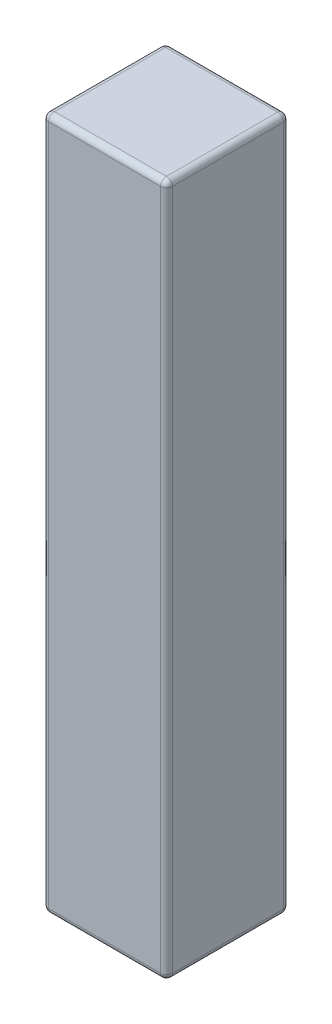
ISO-10303-21;
HEADER;
FILE_DESCRIPTION(('STEP AP214'),'2;1');
FILE_NAME('part.step','',(''),(''),'','','');
FILE_SCHEMA(('AUTOMOTIVE_DESIGN { 1 0 10303 214 1 1 1 1 }'));
ENDSEC;
DATA;
#1=APPLICATION_CONTEXT('core data for automotive mechanical design processes');
#2=APPLICATION_PROTOCOL_DEFINITION('international standard','automotive_design',2000,#1);
#3=PRODUCT_CONTEXT('',#1,'mechanical');
#4=PRODUCT('Part','Part','',(#3));
#5=PRODUCT_RELATED_PRODUCT_CATEGORY('part','',(#4));
#6=PRODUCT_DEFINITION_FORMATION('','',#4);
#7=PRODUCT_DEFINITION_CONTEXT('part definition',#1,'design');
#8=PRODUCT_DEFINITION('design','',#6,#7);
#9=PRODUCT_DEFINITION_SHAPE('','',#8);
#10=(LENGTH_UNIT() NAMED_UNIT(*) SI_UNIT(.MILLI.,.METRE.));
#11=(NAMED_UNIT(*) PLANE_ANGLE_UNIT() SI_UNIT($,.RADIAN.));
#12=(NAMED_UNIT(*) SI_UNIT($,.STERADIAN.) SOLID_ANGLE_UNIT());
#13=UNCERTAINTY_MEASURE_WITH_UNIT(LENGTH_MEASURE(1.E-05),#10,'distance_accuracy_value','');
#14=(GEOMETRIC_REPRESENTATION_CONTEXT(3) GLOBAL_UNCERTAINTY_ASSIGNED_CONTEXT((#13)) GLOBAL_UNIT_ASSIGNED_CONTEXT((#10,
#11,#12)) REPRESENTATION_CONTEXT('',''));
#15=CARTESIAN_POINT('',(0.,0.,0.));
#16=DIRECTION('',(0.,0.,1.));
#17=DIRECTION('',(1.,0.,0.));
#18=AXIS2_PLACEMENT_3D('',#15,#16,#17);
#19=CARTESIAN_POINT('',(-1.5875,17.78,-1.5748));
#20=DIRECTION('',(1.,0.,0.));
#21=DIRECTION('',(0.,0.,-1.));
#22=AXIS2_PLACEMENT_3D('',#19,#20,#21);
#23=PLANE('',#22);
#24=DIRECTION('',(0.,0.,1.));
#25=VECTOR('',#24,1.);
#26=CARTESIAN_POINT('',(-1.5875,0.149999999999997,-1.5748));
#27=LINE('',#26,#25);
#28=CARTESIAN_POINT('',(-1.5875,0.149999999999997,-1.4248));
#29=VERTEX_POINT('',#28);
#30=CARTESIAN_POINT('',(-1.5875,0.149999999999997,1.4248));
#31=VERTEX_POINT('',#30);
#32=EDGE_CURVE('E218',#29,#31,#27,.T.);
#33=ORIENTED_EDGE('',*,*,#32,.T.);
#34=DIRECTION('',(0.,-1.,0.));
#35=VECTOR('',#34,1.);
#36=CARTESIAN_POINT('',(-1.5875,17.78,1.4248));
#37=LINE('',#36,#35);
#38=CARTESIAN_POINT('',(-1.5875,17.63,1.4248));
#39=VERTEX_POINT('',#38);
#40=EDGE_CURVE('E225',#31,#39,#37,.F.);
#41=ORIENTED_EDGE('',*,*,#40,.T.);
#42=DIRECTION('',(0.,0.,1.));
#43=VECTOR('',#42,1.);
#44=CARTESIAN_POINT('',(-1.5875,17.63,-1.5748));
#45=LINE('',#44,#43);
#46=CARTESIAN_POINT('',(-1.5875,17.63,-1.4248));
#47=VERTEX_POINT('',#46);
#48=EDGE_CURVE('E216',#39,#47,#45,.F.);
#49=ORIENTED_EDGE('',*,*,#48,.T.);
#50=DIRECTION('',(0.,-1.,0.));
#51=VECTOR('',#50,1.);
#52=CARTESIAN_POINT('',(-1.5875,17.78,-1.4248));
#53=LINE('',#52,#51);
#54=EDGE_CURVE('E213',#47,#29,#53,.T.);
#55=ORIENTED_EDGE('',*,*,#54,.T.);
#56=EDGE_LOOP('',(#33,#41,#49,#55));
#57=FACE_BOUND('',#56,.T.);
#58=ADVANCED_FACE('F34',(#57),#23,.F.);
#59=CARTESIAN_POINT('',(-1.5875,17.78,1.5748));
#60=DIRECTION('',(0.,0.,-1.));
#61=DIRECTION('',(-1.,0.,0.));
#62=AXIS2_PLACEMENT_3D('',#59,#60,#61);
#63=PLANE('',#62);
#64=DIRECTION('',(0.,-1.,0.));
#65=VECTOR('',#64,1.);
#66=CARTESIAN_POINT('',(-1.4375,17.78,1.5748));
#67=LINE('',#66,#65);
#68=CARTESIAN_POINT('',(-1.4375,17.63,1.5748));
#69=VERTEX_POINT('',#68);
#70=CARTESIAN_POINT('',(-1.4375,0.149999999999997,1.5748));
#71=VERTEX_POINT('',#70);
#72=EDGE_CURVE('E132',#69,#71,#67,.T.);
#73=ORIENTED_EDGE('',*,*,#72,.T.);
#74=DIRECTION('',(1.,0.,0.));
#75=VECTOR('',#74,1.);
#76=CARTESIAN_POINT('',(-1.5875,0.149999999999997,1.5748));
#77=LINE('',#76,#75);
#78=CARTESIAN_POINT('',(1.4375,0.149999999999997,1.5748));
#79=VERTEX_POINT('',#78);
#80=EDGE_CURVE('E128',#71,#79,#77,.T.);
#81=ORIENTED_EDGE('',*,*,#80,.T.);
#82=DIRECTION('',(0.,-1.,0.));
#83=VECTOR('',#82,1.);
#84=CARTESIAN_POINT('',(1.4375,17.78,1.5748));
#85=LINE('',#84,#83);
#86=CARTESIAN_POINT('',(1.4375,17.63,1.5748));
#87=VERTEX_POINT('',#86);
#88=EDGE_CURVE('E122',#79,#87,#85,.F.);
#89=ORIENTED_EDGE('',*,*,#88,.T.);
#90=DIRECTION('',(1.,0.,0.));
#91=VECTOR('',#90,1.);
#92=CARTESIAN_POINT('',(-1.5875,17.63,1.5748));
#93=LINE('',#92,#91);
#94=EDGE_CURVE('E125',#87,#69,#93,.F.);
#95=ORIENTED_EDGE('',*,*,#94,.T.);
#96=EDGE_LOOP('',(#73,#81,#89,#95));
#97=FACE_BOUND('',#96,.T.);
#98=ADVANCED_FACE('F124',(#97),#63,.F.);
#99=CARTESIAN_POINT('',(1.5875,17.78,-1.5748));
#100=DIRECTION('',(-1.,0.,0.));
#101=DIRECTION('',(0.,0.,1.));
#102=AXIS2_PLACEMENT_3D('',#99,#100,#101);
#103=PLANE('',#102);
#104=DIRECTION('',(0.,0.,-1.));
#105=VECTOR('',#104,1.);
#106=CARTESIAN_POINT('',(1.5875,17.63,1.5748));
#107=LINE('',#106,#105);
#108=CARTESIAN_POINT('',(1.5875,17.63,-1.4248));
#109=VERTEX_POINT('',#108);
#110=CARTESIAN_POINT('',(1.5875,17.63,1.4248));
#111=VERTEX_POINT('',#110);
#112=EDGE_CURVE('E278',#109,#111,#107,.F.);
#113=ORIENTED_EDGE('',*,*,#112,.T.);
#114=DIRECTION('',(0.,-1.,0.));
#115=VECTOR('',#114,1.);
#116=CARTESIAN_POINT('',(1.5875,17.78,1.4248));
#117=LINE('',#116,#115);
#118=CARTESIAN_POINT('',(1.5875,0.149999999999997,1.4248));
#119=VERTEX_POINT('',#118);
#120=EDGE_CURVE('E155',#111,#119,#117,.T.);
#121=ORIENTED_EDGE('',*,*,#120,.T.);
#122=DIRECTION('',(0.,0.,-1.));
#123=VECTOR('',#122,1.);
#124=CARTESIAN_POINT('',(1.5875,0.149999999999997,-1.5748));
#125=LINE('',#124,#123);
#126=CARTESIAN_POINT('',(1.5875,0.149999999999997,-1.4248));
#127=VERTEX_POINT('',#126);
#128=EDGE_CURVE('E220',#119,#127,#125,.T.);
#129=ORIENTED_EDGE('',*,*,#128,.T.);
#130=DIRECTION('',(0.,-1.,0.));
#131=VECTOR('',#130,1.);
#132=CARTESIAN_POINT('',(1.5875,17.78,-1.4248));
#133=LINE('',#132,#131);
#134=EDGE_CURVE('E276',#127,#109,#133,.F.);
#135=ORIENTED_EDGE('',*,*,#134,.T.);
#136=EDGE_LOOP('',(#113,#121,#129,#135));
#137=FACE_BOUND('',#136,.T.);
#138=ADVANCED_FACE('F285',(#137),#103,.F.);
#139=CARTESIAN_POINT('',(-1.5875,17.78,-1.5748));
#140=DIRECTION('',(0.,0.,1.));
#141=DIRECTION('',(1.,0.,0.));
#142=AXIS2_PLACEMENT_3D('',#139,#140,#141);
#143=PLANE('',#142);
#144=DIRECTION('',(-1.,0.,0.));
#145=VECTOR('',#144,1.);
#146=CARTESIAN_POINT('',(1.5875,17.63,-1.5748));
#147=LINE('',#146,#145);
#148=CARTESIAN_POINT('',(-1.4375,17.63,-1.5748));
#149=VERTEX_POINT('',#148);
#150=CARTESIAN_POINT('',(1.4375,17.63,-1.5748));
#151=VERTEX_POINT('',#150);
#152=EDGE_CURVE('E43',#149,#151,#147,.F.);
#153=ORIENTED_EDGE('',*,*,#152,.T.);
#154=DIRECTION('',(0.,-1.,0.));
#155=VECTOR('',#154,1.);
#156=CARTESIAN_POINT('',(1.4375,17.78,-1.5748));
#157=LINE('',#156,#155);
#158=CARTESIAN_POINT('',(1.4375,0.149999999999997,-1.5748));
#159=VERTEX_POINT('',#158);
#160=EDGE_CURVE('E11',#151,#159,#157,.T.);
#161=ORIENTED_EDGE('',*,*,#160,.T.);
#162=DIRECTION('',(-1.,0.,0.));
#163=VECTOR('',#162,1.);
#164=CARTESIAN_POINT('',(-1.5875,0.149999999999997,-1.5748));
#165=LINE('',#164,#163);
#166=CARTESIAN_POINT('',(-1.4375,0.149999999999997,-1.5748));
#167=VERTEX_POINT('',#166);
#168=EDGE_CURVE('E237',#159,#167,#165,.T.);
#169=ORIENTED_EDGE('',*,*,#168,.T.);
#170=DIRECTION('',(0.,-1.,0.));
#171=VECTOR('',#170,1.);
#172=CARTESIAN_POINT('',(-1.4375,17.78,-1.5748));
#173=LINE('',#172,#171);
#174=EDGE_CURVE('E54',#167,#149,#173,.F.);
#175=ORIENTED_EDGE('',*,*,#174,.T.);
#176=EDGE_LOOP('',(#153,#161,#169,#175));
#177=FACE_BOUND('',#176,.T.);
#178=ADVANCED_FACE('F316',(#177),#143,.F.);
#179=CARTESIAN_POINT('',(-1.5875,17.78,1.5748));
#180=DIRECTION('',(0.,1.,0.));
#181=DIRECTION('',(0.,0.,1.));
#182=AXIS2_PLACEMENT_3D('',#179,#180,#181);
#183=PLANE('',#182);
#184=DIRECTION('',(1.,0.,0.));
#185=VECTOR('',#184,1.);
#186=CARTESIAN_POINT('',(1.5875,17.78,1.4248));
#187=LINE('',#186,#185);
#188=CARTESIAN_POINT('',(-1.4375,17.78,1.4248));
#189=VERTEX_POINT('',#188);
#190=CARTESIAN_POINT('',(1.4375,17.78,1.4248));
#191=VERTEX_POINT('',#190);
#192=EDGE_CURVE('E232',#189,#191,#187,.T.);
#193=ORIENTED_EDGE('',*,*,#192,.T.);
#194=DIRECTION('',(0.,0.,-1.));
#195=VECTOR('',#194,1.);
#196=CARTESIAN_POINT('',(1.4375,17.78,-1.5748));
#197=LINE('',#196,#195);
#198=CARTESIAN_POINT('',(1.4375,17.78,-1.4248));
#199=VERTEX_POINT('',#198);
#200=EDGE_CURVE('E234',#191,#199,#197,.T.);
#201=ORIENTED_EDGE('',*,*,#200,.T.);
#202=DIRECTION('',(-1.,0.,0.));
#203=VECTOR('',#202,1.);
#204=CARTESIAN_POINT('',(-1.5875,17.78,-1.4248));
#205=LINE('',#204,#203);
#206=CARTESIAN_POINT('',(-1.4375,17.78,-1.4248));
#207=VERTEX_POINT('',#206);
#208=EDGE_CURVE('E228',#199,#207,#205,.T.);
#209=ORIENTED_EDGE('',*,*,#208,.T.);
#210=DIRECTION('',(0.,0.,1.));
#211=VECTOR('',#210,1.);
#212=CARTESIAN_POINT('',(-1.4375,17.78,1.5748));
#213=LINE('',#212,#211);
#214=EDGE_CURVE('E230',#207,#189,#213,.T.);
#215=ORIENTED_EDGE('',*,*,#214,.T.);
#216=EDGE_LOOP('',(#193,#201,#209,#215));
#217=FACE_BOUND('',#216,.T.);
#218=ADVANCED_FACE('F312',(#217),#183,.T.);
#219=CARTESIAN_POINT('',(-1.5875,0.,1.5748));
#220=DIRECTION('',(0.,1.,0.));
#221=DIRECTION('',(0.,0.,1.));
#222=AXIS2_PLACEMENT_3D('',#219,#220,#221);
#223=PLANE('',#222);
#224=DIRECTION('',(0.,0.,-1.));
#225=VECTOR('',#224,1.);
#226=CARTESIAN_POINT('',(1.4375,0.,1.5748));
#227=LINE('',#226,#225);
#228=CARTESIAN_POINT('',(1.4375,0.,-1.4248));
#229=VERTEX_POINT('',#228);
#230=CARTESIAN_POINT('',(1.4375,0.,1.4248));
#231=VERTEX_POINT('',#230);
#232=EDGE_CURVE('E266',#229,#231,#227,.F.);
#233=ORIENTED_EDGE('',*,*,#232,.T.);
#234=DIRECTION('',(1.,0.,0.));
#235=VECTOR('',#234,1.);
#236=CARTESIAN_POINT('',(-1.5875,0.,1.4248));
#237=LINE('',#236,#235);
#238=CARTESIAN_POINT('',(-1.4375,0.,1.4248));
#239=VERTEX_POINT('',#238);
#240=EDGE_CURVE('E270',#231,#239,#237,.F.);
#241=ORIENTED_EDGE('',*,*,#240,.T.);
#242=DIRECTION('',(0.,0.,1.));
#243=VECTOR('',#242,1.);
#244=CARTESIAN_POINT('',(-1.4375,0.,1.5748));
#245=LINE('',#244,#243);
#246=CARTESIAN_POINT('',(-1.4375,0.,-1.4248));
#247=VERTEX_POINT('',#246);
#248=EDGE_CURVE('E261',#239,#247,#245,.F.);
#249=ORIENTED_EDGE('',*,*,#248,.T.);
#250=DIRECTION('',(-1.,0.,0.));
#251=VECTOR('',#250,1.);
#252=CARTESIAN_POINT('',(-1.5875,0.,-1.4248));
#253=LINE('',#252,#251);
#254=EDGE_CURVE('E267',#247,#229,#253,.F.);
#255=ORIENTED_EDGE('',*,*,#254,.T.);
#256=EDGE_LOOP('',(#233,#241,#249,#255));
#257=FACE_BOUND('',#256,.T.);
#258=ADVANCED_FACE('F271',(#257),#223,.F.);
#259=CARTESIAN_POINT('',(-1.5875,17.63,-1.4248));
#260=DIRECTION('',(1.,0.,0.));
#261=DIRECTION('',(0.,0.,-1.));
#262=AXIS2_PLACEMENT_3D('',#259,#260,#261);
#263=CYLINDRICAL_SURFACE('',#262,0.15);
#264=CARTESIAN_POINT('',(-1.4375,17.63,-1.4248));
#265=DIRECTION('',(-1.,0.,0.));
#266=DIRECTION('',(0.,0.,1.));
#267=AXIS2_PLACEMENT_3D('',#264,#265,#266);
#268=CIRCLE('',#267,0.15);
#269=EDGE_CURVE('E38',#207,#149,#268,.T.);
#270=ORIENTED_EDGE('',*,*,#269,.F.);
#271=ORIENTED_EDGE('',*,*,#208,.F.);
#272=CARTESIAN_POINT('',(1.4375,17.63,-1.4248));
#273=DIRECTION('',(1.,0.,0.));
#274=DIRECTION('',(0.,0.,-1.));
#275=AXIS2_PLACEMENT_3D('',#272,#273,#274);
#276=CIRCLE('',#275,0.15);
#277=EDGE_CURVE('E194',#151,#199,#276,.T.);
#278=ORIENTED_EDGE('',*,*,#277,.F.);
#279=ORIENTED_EDGE('',*,*,#152,.F.);
#280=EDGE_LOOP('',(#270,#271,#278,#279));
#281=FACE_BOUND('',#280,.T.);
#282=ADVANCED_FACE('F36',(#281),#263,.T.);
#283=CARTESIAN_POINT('',(-1.4375,17.63,-1.4248));
#284=DIRECTION('',(0.,0.,1.));
#285=DIRECTION('',(1.,0.,0.));
#286=AXIS2_PLACEMENT_3D('',#283,#284,#285);
#287=SPHERICAL_SURFACE('',#286,0.15);
#288=CARTESIAN_POINT('',(-1.4375,17.63,-1.4248));
#289=DIRECTION('',(0.,0.,-1.));
#290=DIRECTION('',(-1.,0.,0.));
#291=AXIS2_PLACEMENT_3D('',#288,#289,#290);
#292=CIRCLE('',#291,0.15);
#293=EDGE_CURVE('E189',#207,#47,#292,.F.);
#294=ORIENTED_EDGE('',*,*,#293,.F.);
#295=ORIENTED_EDGE('',*,*,#269,.T.);
#296=CARTESIAN_POINT('',(-1.4375,17.63,-1.4248));
#297=DIRECTION('',(0.,1.,0.));
#298=DIRECTION('',(0.,0.,1.));
#299=AXIS2_PLACEMENT_3D('',#296,#297,#298);
#300=CIRCLE('',#299,0.15);
#301=EDGE_CURVE('E192',#47,#149,#300,.F.);
#302=ORIENTED_EDGE('',*,*,#301,.F.);
#303=EDGE_LOOP('',(#294,#295,#302));
#304=FACE_BOUND('',#303,.T.);
#305=ADVANCED_FACE('F205',(#304),#287,.T.);
#306=CARTESIAN_POINT('',(1.4375,17.63,-1.4248));
#307=DIRECTION('',(0.,0.,1.));
#308=DIRECTION('',(1.,0.,0.));
#309=AXIS2_PLACEMENT_3D('',#306,#307,#308);
#310=SPHERICAL_SURFACE('',#309,0.15);
#311=CARTESIAN_POINT('',(1.4375,17.63,-1.4248));
#312=DIRECTION('',(0.,1.,0.));
#313=DIRECTION('',(0.,0.,1.));
#314=AXIS2_PLACEMENT_3D('',#311,#312,#313);
#315=CIRCLE('',#314,0.15);
#316=EDGE_CURVE('E184',#151,#109,#315,.F.);
#317=ORIENTED_EDGE('',*,*,#316,.F.);
#318=ORIENTED_EDGE('',*,*,#277,.T.);
#319=CARTESIAN_POINT('',(1.4375,17.63,-1.4248));
#320=DIRECTION('',(0.,0.,-1.));
#321=DIRECTION('',(-1.,0.,0.));
#322=AXIS2_PLACEMENT_3D('',#319,#320,#321);
#323=CIRCLE('',#322,0.15);
#324=EDGE_CURVE('E187',#109,#199,#323,.F.);
#325=ORIENTED_EDGE('',*,*,#324,.F.);
#326=EDGE_LOOP('',(#317,#318,#325));
#327=FACE_BOUND('',#326,.T.);
#328=ADVANCED_FACE('F314',(#327),#310,.T.);
#329=CARTESIAN_POINT('',(-1.4375,17.78,-1.4248));
#330=DIRECTION('',(0.,-1.,0.));
#331=DIRECTION('',(0.,0.,-1.));
#332=AXIS2_PLACEMENT_3D('',#329,#330,#331);
#333=CYLINDRICAL_SURFACE('',#332,0.15);
#334=ORIENTED_EDGE('',*,*,#301,.T.);
#335=ORIENTED_EDGE('',*,*,#174,.F.);
#336=CARTESIAN_POINT('',(-1.4375,0.149999999999997,-1.4248));
#337=DIRECTION('',(0.,-1.,0.));
#338=DIRECTION('',(0.,0.,-1.));
#339=AXIS2_PLACEMENT_3D('',#336,#337,#338);
#340=CIRCLE('',#339,0.15);
#341=EDGE_CURVE('E178',#29,#167,#340,.T.);
#342=ORIENTED_EDGE('',*,*,#341,.F.);
#343=ORIENTED_EDGE('',*,*,#54,.F.);
#344=EDGE_LOOP('',(#334,#335,#342,#343));
#345=FACE_BOUND('',#344,.T.);
#346=ADVANCED_FACE('F210',(#345),#333,.T.);
#347=CARTESIAN_POINT('',(-1.4375,17.63,1.5748));
#348=DIRECTION('',(0.,0.,-1.));
#349=DIRECTION('',(-1.,0.,0.));
#350=AXIS2_PLACEMENT_3D('',#347,#348,#349);
#351=CYLINDRICAL_SURFACE('',#350,0.15);
#352=ORIENTED_EDGE('',*,*,#293,.T.);
#353=ORIENTED_EDGE('',*,*,#48,.F.);
#354=CARTESIAN_POINT('',(-1.4375,17.63,1.4248));
#355=DIRECTION('',(0.,0.,1.));
#356=DIRECTION('',(1.,0.,0.));
#357=AXIS2_PLACEMENT_3D('',#354,#355,#356);
#358=CIRCLE('',#357,0.15);
#359=EDGE_CURVE('E175',#189,#39,#358,.T.);
#360=ORIENTED_EDGE('',*,*,#359,.F.);
#361=ORIENTED_EDGE('',*,*,#214,.F.);
#362=EDGE_LOOP('',(#352,#353,#360,#361));
#363=FACE_BOUND('',#362,.T.);
#364=ADVANCED_FACE('F310',(#363),#351,.T.);
#365=CARTESIAN_POINT('',(-1.5875,17.63,1.4248));
#366=DIRECTION('',(-1.,0.,0.));
#367=DIRECTION('',(0.,0.,1.));
#368=AXIS2_PLACEMENT_3D('',#365,#366,#367);
#369=CYLINDRICAL_SURFACE('',#368,0.15);
#370=CARTESIAN_POINT('',(1.4375,17.63,1.4248));
#371=DIRECTION('',(1.,0.,0.));
#372=DIRECTION('',(0.,0.,-1.));
#373=AXIS2_PLACEMENT_3D('',#370,#371,#372);
#374=CIRCLE('',#373,0.15);
#375=EDGE_CURVE('E139',#191,#87,#374,.T.);
#376=ORIENTED_EDGE('',*,*,#375,.F.);
#377=ORIENTED_EDGE('',*,*,#192,.F.);
#378=CARTESIAN_POINT('',(-1.4375,17.63,1.4248));
#379=DIRECTION('',(-1.,0.,0.));
#380=DIRECTION('',(0.,0.,1.));
#381=AXIS2_PLACEMENT_3D('',#378,#379,#380);
#382=CIRCLE('',#381,0.15);
#383=EDGE_CURVE('E142',#69,#189,#382,.T.);
#384=ORIENTED_EDGE('',*,*,#383,.F.);
#385=ORIENTED_EDGE('',*,*,#94,.F.);
#386=EDGE_LOOP('',(#376,#377,#384,#385));
#387=FACE_BOUND('',#386,.T.);
#388=ADVANCED_FACE('F137',(#387),#369,.T.);
#389=CARTESIAN_POINT('',(1.4375,17.63,1.5748));
#390=DIRECTION('',(0.,0.,1.));
#391=DIRECTION('',(1.,0.,0.));
#392=AXIS2_PLACEMENT_3D('',#389,#390,#391);
#393=CYLINDRICAL_SURFACE('',#392,0.15);
#394=ORIENTED_EDGE('',*,*,#324,.T.);
#395=ORIENTED_EDGE('',*,*,#200,.F.);
#396=CARTESIAN_POINT('',(1.4375,17.63,1.4248));
#397=DIRECTION('',(0.,0.,1.));
#398=DIRECTION('',(1.,0.,0.));
#399=AXIS2_PLACEMENT_3D('',#396,#397,#398);
#400=CIRCLE('',#399,0.15);
#401=EDGE_CURVE('E151',#111,#191,#400,.T.);
#402=ORIENTED_EDGE('',*,*,#401,.F.);
#403=ORIENTED_EDGE('',*,*,#112,.F.);
#404=EDGE_LOOP('',(#394,#395,#402,#403));
#405=FACE_BOUND('',#404,.T.);
#406=ADVANCED_FACE('F431',(#405),#393,.T.);
#407=CARTESIAN_POINT('',(1.4375,17.78,-1.4248));
#408=DIRECTION('',(0.,-1.,0.));
#409=DIRECTION('',(0.,0.,-1.));
#410=AXIS2_PLACEMENT_3D('',#407,#408,#409);
#411=CYLINDRICAL_SURFACE('',#410,0.15);
#412=ORIENTED_EDGE('',*,*,#316,.T.);
#413=ORIENTED_EDGE('',*,*,#134,.F.);
#414=CARTESIAN_POINT('',(1.4375,0.149999999999997,-1.4248));
#415=DIRECTION('',(0.,-1.,0.));
#416=DIRECTION('',(0.,0.,-1.));
#417=AXIS2_PLACEMENT_3D('',#414,#415,#416);
#418=CIRCLE('',#417,0.15);
#419=EDGE_CURVE('E170',#159,#127,#418,.T.);
#420=ORIENTED_EDGE('',*,*,#419,.F.);
#421=ORIENTED_EDGE('',*,*,#160,.F.);
#422=EDGE_LOOP('',(#412,#413,#420,#421));
#423=FACE_BOUND('',#422,.T.);
#424=ADVANCED_FACE('F289',(#423),#411,.T.);
#425=CARTESIAN_POINT('',(-1.5875,0.149999999999997,-1.4248));
#426=DIRECTION('',(-1.,0.,0.));
#427=DIRECTION('',(0.,0.,1.));
#428=AXIS2_PLACEMENT_3D('',#425,#426,#427);
#429=CYLINDRICAL_SURFACE('',#428,0.15);
#430=CARTESIAN_POINT('',(-1.4375,0.149999999999997,-1.4248));
#431=DIRECTION('',(-1.,0.,0.));
#432=DIRECTION('',(0.,0.,1.));
#433=AXIS2_PLACEMENT_3D('',#430,#431,#432);
#434=CIRCLE('',#433,0.15);
#435=EDGE_CURVE('E181',#167,#247,#434,.T.);
#436=ORIENTED_EDGE('',*,*,#435,.F.);
#437=ORIENTED_EDGE('',*,*,#168,.F.);
#438=CARTESIAN_POINT('',(1.4375,0.149999999999997,-1.4248));
#439=DIRECTION('',(1.,0.,0.));
#440=DIRECTION('',(0.,0.,-1.));
#441=AXIS2_PLACEMENT_3D('',#438,#439,#440);
#442=CIRCLE('',#441,0.15);
#443=EDGE_CURVE('E168',#229,#159,#442,.T.);
#444=ORIENTED_EDGE('',*,*,#443,.F.);
#445=ORIENTED_EDGE('',*,*,#254,.F.);
#446=EDGE_LOOP('',(#436,#437,#444,#445));
#447=FACE_BOUND('',#446,.T.);
#448=ADVANCED_FACE('F318',(#447),#429,.T.);
#449=CARTESIAN_POINT('',(-1.4375,0.149999999999997,-1.4248));
#450=DIRECTION('',(0.,0.,1.));
#451=DIRECTION('',(1.,0.,0.));
#452=AXIS2_PLACEMENT_3D('',#449,#450,#451);
#453=SPHERICAL_SURFACE('',#452,0.15);
#454=ORIENTED_EDGE('',*,*,#341,.T.);
#455=ORIENTED_EDGE('',*,*,#435,.T.);
#456=CARTESIAN_POINT('',(-1.4375,0.149999999999997,-1.4248));
#457=DIRECTION('',(0.,0.,-1.));
#458=DIRECTION('',(-1.,0.,0.));
#459=AXIS2_PLACEMENT_3D('',#456,#457,#458);
#460=CIRCLE('',#459,0.15);
#461=EDGE_CURVE('E159',#29,#247,#460,.F.);
#462=ORIENTED_EDGE('',*,*,#461,.F.);
#463=EDGE_LOOP('',(#454,#455,#462));
#464=FACE_BOUND('',#463,.T.);
#465=ADVANCED_FACE('F320',(#464),#453,.T.);
#466=CARTESIAN_POINT('',(-1.4375,17.63,1.4248));
#467=DIRECTION('',(0.,0.,1.));
#468=DIRECTION('',(1.,0.,0.));
#469=AXIS2_PLACEMENT_3D('',#466,#467,#468);
#470=SPHERICAL_SURFACE('',#469,0.15);
#471=ORIENTED_EDGE('',*,*,#383,.T.);
#472=ORIENTED_EDGE('',*,*,#359,.T.);
#473=CARTESIAN_POINT('',(-1.4375,17.63,1.4248));
#474=DIRECTION('',(0.,1.,0.));
#475=DIRECTION('',(0.,0.,1.));
#476=AXIS2_PLACEMENT_3D('',#473,#474,#475);
#477=CIRCLE('',#476,0.15);
#478=EDGE_CURVE('E156',#69,#39,#477,.F.);
#479=ORIENTED_EDGE('',*,*,#478,.F.);
#480=EDGE_LOOP('',(#471,#472,#479));
#481=FACE_BOUND('',#480,.T.);
#482=ADVANCED_FACE('F322',(#481),#470,.T.);
#483=CARTESIAN_POINT('',(1.4375,17.63,1.4248));
#484=DIRECTION('',(0.,0.,1.));
#485=DIRECTION('',(1.,0.,0.));
#486=AXIS2_PLACEMENT_3D('',#483,#484,#485);
#487=SPHERICAL_SURFACE('',#486,0.15);
#488=ORIENTED_EDGE('',*,*,#401,.T.);
#489=ORIENTED_EDGE('',*,*,#375,.T.);
#490=CARTESIAN_POINT('',(1.4375,17.63,1.4248));
#491=DIRECTION('',(0.,1.,0.));
#492=DIRECTION('',(0.,0.,1.));
#493=AXIS2_PLACEMENT_3D('',#490,#491,#492);
#494=CIRCLE('',#493,0.15);
#495=EDGE_CURVE('E148',#111,#87,#494,.F.);
#496=ORIENTED_EDGE('',*,*,#495,.F.);
#497=EDGE_LOOP('',(#488,#489,#496));
#498=FACE_BOUND('',#497,.T.);
#499=ADVANCED_FACE('F147',(#498),#487,.T.);
#500=CARTESIAN_POINT('',(1.4375,0.149999999999997,-1.4248));
#501=DIRECTION('',(0.,0.,1.));
#502=DIRECTION('',(1.,0.,0.));
#503=AXIS2_PLACEMENT_3D('',#500,#501,#502);
#504=SPHERICAL_SURFACE('',#503,0.15);
#505=ORIENTED_EDGE('',*,*,#443,.T.);
#506=ORIENTED_EDGE('',*,*,#419,.T.);
#507=CARTESIAN_POINT('',(1.4375,0.149999999999997,-1.4248));
#508=DIRECTION('',(0.,0.,-1.));
#509=DIRECTION('',(-1.,0.,0.));
#510=AXIS2_PLACEMENT_3D('',#507,#508,#509);
#511=CIRCLE('',#510,0.15);
#512=EDGE_CURVE('E157',#229,#127,#511,.F.);
#513=ORIENTED_EDGE('',*,*,#512,.F.);
#514=EDGE_LOOP('',(#505,#506,#513));
#515=FACE_BOUND('',#514,.T.);
#516=ADVANCED_FACE('F294',(#515),#504,.T.);
#517=CARTESIAN_POINT('',(-1.4375,0.149999999999997,-1.5748));
#518=DIRECTION('',(0.,0.,1.));
#519=DIRECTION('',(1.,0.,0.));
#520=AXIS2_PLACEMENT_3D('',#517,#518,#519);
#521=CYLINDRICAL_SURFACE('',#520,0.15);
#522=ORIENTED_EDGE('',*,*,#461,.T.);
#523=ORIENTED_EDGE('',*,*,#248,.F.);
#524=CARTESIAN_POINT('',(-1.4375,0.149999999999997,1.4248));
#525=DIRECTION('',(0.,0.,1.));
#526=DIRECTION('',(1.,0.,0.));
#527=AXIS2_PLACEMENT_3D('',#524,#525,#526);
#528=CIRCLE('',#527,0.15);
#529=EDGE_CURVE('E162',#31,#239,#528,.T.);
#530=ORIENTED_EDGE('',*,*,#529,.F.);
#531=ORIENTED_EDGE('',*,*,#32,.F.);
#532=EDGE_LOOP('',(#522,#523,#530,#531));
#533=FACE_BOUND('',#532,.T.);
#534=ADVANCED_FACE('F263',(#533),#521,.T.);
#535=CARTESIAN_POINT('',(-1.4375,17.78,1.4248));
#536=DIRECTION('',(0.,-1.,0.));
#537=DIRECTION('',(0.,0.,-1.));
#538=AXIS2_PLACEMENT_3D('',#535,#536,#537);
#539=CYLINDRICAL_SURFACE('',#538,0.15);
#540=ORIENTED_EDGE('',*,*,#478,.T.);
#541=ORIENTED_EDGE('',*,*,#40,.F.);
#542=CARTESIAN_POINT('',(-1.4375,0.149999999999997,1.4248));
#543=DIRECTION('',(0.,-1.,0.));
#544=DIRECTION('',(0.,0.,-1.));
#545=AXIS2_PLACEMENT_3D('',#542,#543,#544);
#546=CIRCLE('',#545,0.15);
#547=EDGE_CURVE('E250',#71,#31,#546,.T.);
#548=ORIENTED_EDGE('',*,*,#547,.F.);
#549=ORIENTED_EDGE('',*,*,#72,.F.);
#550=EDGE_LOOP('',(#540,#541,#548,#549));
#551=FACE_BOUND('',#550,.T.);
#552=ADVANCED_FACE('F306',(#551),#539,.T.);
#553=CARTESIAN_POINT('',(1.4375,17.78,1.4248));
#554=DIRECTION('',(0.,-1.,0.));
#555=DIRECTION('',(0.,0.,-1.));
#556=AXIS2_PLACEMENT_3D('',#553,#554,#555);
#557=CYLINDRICAL_SURFACE('',#556,0.15);
#558=ORIENTED_EDGE('',*,*,#495,.T.);
#559=ORIENTED_EDGE('',*,*,#88,.F.);
#560=CARTESIAN_POINT('',(1.4375,0.149999999999997,1.4248));
#561=DIRECTION('',(0.,-1.,0.));
#562=DIRECTION('',(0.,0.,-1.));
#563=AXIS2_PLACEMENT_3D('',#560,#561,#562);
#564=CIRCLE('',#563,0.15);
#565=EDGE_CURVE('E247',#119,#79,#564,.T.);
#566=ORIENTED_EDGE('',*,*,#565,.F.);
#567=ORIENTED_EDGE('',*,*,#120,.F.);
#568=EDGE_LOOP('',(#558,#559,#566,#567));
#569=FACE_BOUND('',#568,.T.);
#570=ADVANCED_FACE('F153',(#569),#557,.T.);
#571=CARTESIAN_POINT('',(1.4375,0.149999999999997,-1.5748));
#572=DIRECTION('',(0.,0.,-1.));
#573=DIRECTION('',(-1.,0.,0.));
#574=AXIS2_PLACEMENT_3D('',#571,#572,#573);
#575=CYLINDRICAL_SURFACE('',#574,0.15);
#576=ORIENTED_EDGE('',*,*,#512,.T.);
#577=ORIENTED_EDGE('',*,*,#128,.F.);
#578=CARTESIAN_POINT('',(1.4375,0.149999999999997,1.4248));
#579=DIRECTION('',(0.,0.,1.));
#580=DIRECTION('',(1.,0.,0.));
#581=AXIS2_PLACEMENT_3D('',#578,#579,#580);
#582=CIRCLE('',#581,0.15);
#583=EDGE_CURVE('E245',#231,#119,#582,.T.);
#584=ORIENTED_EDGE('',*,*,#583,.F.);
#585=ORIENTED_EDGE('',*,*,#232,.F.);
#586=EDGE_LOOP('',(#576,#577,#584,#585));
#587=FACE_BOUND('',#586,.T.);
#588=ADVANCED_FACE('F296',(#587),#575,.T.);
#589=CARTESIAN_POINT('',(-1.4375,0.149999999999997,1.4248));
#590=DIRECTION('',(0.,0.,1.));
#591=DIRECTION('',(1.,0.,0.));
#592=AXIS2_PLACEMENT_3D('',#589,#590,#591);
#593=SPHERICAL_SURFACE('',#592,0.15);
#594=ORIENTED_EDGE('',*,*,#547,.T.);
#595=ORIENTED_EDGE('',*,*,#529,.T.);
#596=CARTESIAN_POINT('',(-1.4375,0.149999999999997,1.4248));
#597=DIRECTION('',(-1.,0.,0.));
#598=DIRECTION('',(0.,0.,1.));
#599=AXIS2_PLACEMENT_3D('',#596,#597,#598);
#600=CIRCLE('',#599,0.15);
#601=EDGE_CURVE('E243',#71,#239,#600,.F.);
#602=ORIENTED_EDGE('',*,*,#601,.F.);
#603=EDGE_LOOP('',(#594,#595,#602));
#604=FACE_BOUND('',#603,.T.);
#605=ADVANCED_FACE('F257',(#604),#593,.T.);
#606=CARTESIAN_POINT('',(1.4375,0.149999999999997,1.4248));
#607=DIRECTION('',(0.,0.,1.));
#608=DIRECTION('',(1.,0.,0.));
#609=AXIS2_PLACEMENT_3D('',#606,#607,#608);
#610=SPHERICAL_SURFACE('',#609,0.15);
#611=ORIENTED_EDGE('',*,*,#583,.T.);
#612=ORIENTED_EDGE('',*,*,#565,.T.);
#613=CARTESIAN_POINT('',(1.4375,0.149999999999997,1.4248));
#614=DIRECTION('',(1.,0.,0.));
#615=DIRECTION('',(0.,0.,-1.));
#616=AXIS2_PLACEMENT_3D('',#613,#614,#615);
#617=CIRCLE('',#616,0.15);
#618=EDGE_CURVE('E241',#231,#79,#617,.F.);
#619=ORIENTED_EDGE('',*,*,#618,.F.);
#620=EDGE_LOOP('',(#611,#612,#619));
#621=FACE_BOUND('',#620,.T.);
#622=ADVANCED_FACE('F298',(#621),#610,.T.);
#623=CARTESIAN_POINT('',(-1.5875,0.149999999999997,1.4248));
#624=DIRECTION('',(1.,0.,0.));
#625=DIRECTION('',(0.,0.,-1.));
#626=AXIS2_PLACEMENT_3D('',#623,#624,#625);
#627=CYLINDRICAL_SURFACE('',#626,0.15);
#628=ORIENTED_EDGE('',*,*,#601,.T.);
#629=ORIENTED_EDGE('',*,*,#240,.F.);
#630=ORIENTED_EDGE('',*,*,#618,.T.);
#631=ORIENTED_EDGE('',*,*,#80,.F.);
#632=EDGE_LOOP('',(#628,#629,#630,#631));
#633=FACE_BOUND('',#632,.T.);
#634=ADVANCED_FACE('F299',(#633),#627,.T.);
#635=CLOSED_SHELL('',(#58,#98,#138,#178,#218,#258,#282,#305,#328,#346,#364,#388,#406,#424,#448,
#465,#482,#499,#516,#534,#552,#570,#588,#605,#622,#634));
#636=MANIFOLD_SOLID_BREP('B2',#635);
#637=ADVANCED_BREP_SHAPE_REPRESENTATION('',(#18,#636),#14);
#638=SHAPE_DEFINITION_REPRESENTATION(#9,#637);
ENDSEC;
END-ISO-10303-21;
